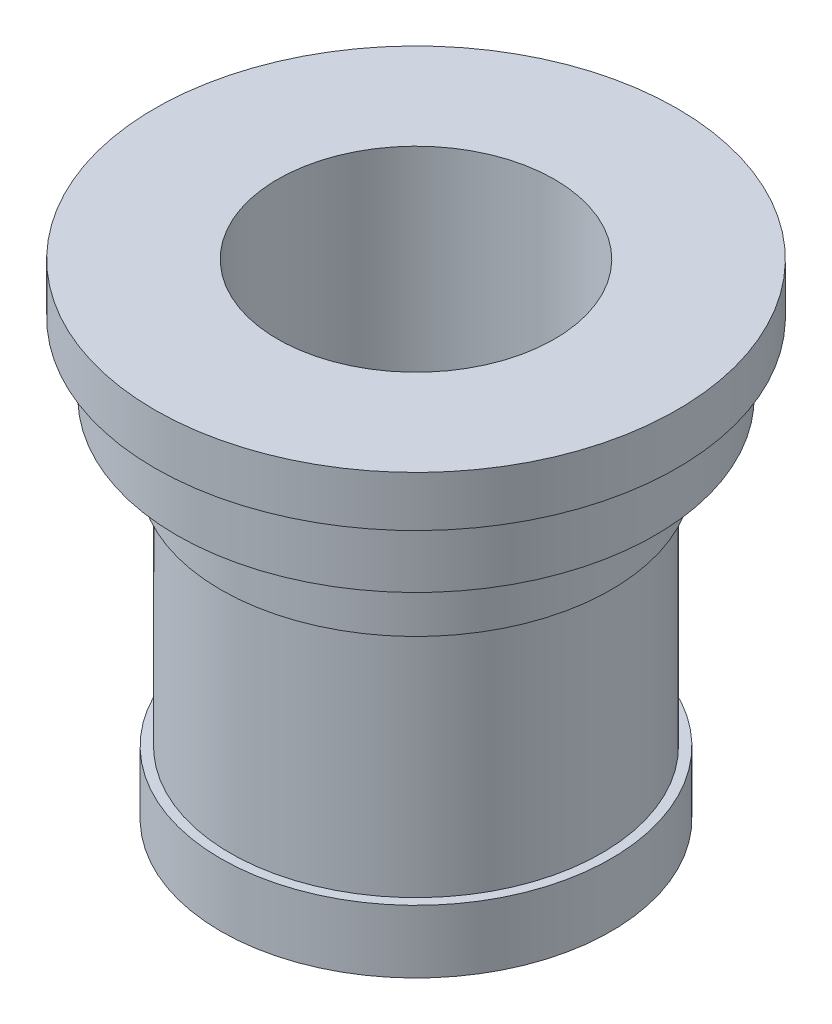
ISO-10303-21;
HEADER;
FILE_DESCRIPTION(('STEP AP214'),'2;1');
FILE_NAME('part.step','',(''),(''),'','','');
FILE_SCHEMA(('AUTOMOTIVE_DESIGN { 1 0 10303 214 1 1 1 1 }'));
ENDSEC;
DATA;
#1=APPLICATION_CONTEXT('core data for automotive mechanical design processes');
#2=APPLICATION_PROTOCOL_DEFINITION('international standard','automotive_design',2000,#1);
#3=PRODUCT_CONTEXT('',#1,'mechanical');
#4=PRODUCT('Part','Part','',(#3));
#5=PRODUCT_RELATED_PRODUCT_CATEGORY('part','',(#4));
#6=PRODUCT_DEFINITION_FORMATION('','',#4);
#7=PRODUCT_DEFINITION_CONTEXT('part definition',#1,'design');
#8=PRODUCT_DEFINITION('design','',#6,#7);
#9=PRODUCT_DEFINITION_SHAPE('','',#8);
#10=(LENGTH_UNIT() NAMED_UNIT(*) SI_UNIT(.MILLI.,.METRE.));
#11=(NAMED_UNIT(*) PLANE_ANGLE_UNIT() SI_UNIT($,.RADIAN.));
#12=(NAMED_UNIT(*) SI_UNIT($,.STERADIAN.) SOLID_ANGLE_UNIT());
#13=UNCERTAINTY_MEASURE_WITH_UNIT(LENGTH_MEASURE(1.E-05),#10,'distance_accuracy_value','');
#14=(GEOMETRIC_REPRESENTATION_CONTEXT(3) GLOBAL_UNCERTAINTY_ASSIGNED_CONTEXT((#13)) GLOBAL_UNIT_ASSIGNED_CONTEXT((#10,
#11,#12)) REPRESENTATION_CONTEXT('',''));
#15=CARTESIAN_POINT('',(0.,0.,0.));
#16=DIRECTION('',(0.,0.,1.));
#17=DIRECTION('',(1.,0.,0.));
#18=AXIS2_PLACEMENT_3D('',#15,#16,#17);
#19=CARTESIAN_POINT('',(41.5,50.2378825634157,0.));
#20=DIRECTION('',(0.,1.,0.));
#21=DIRECTION('',(0.,0.,1.));
#22=AXIS2_PLACEMENT_3D('',#19,#20,#21);
#23=PLANE('',#22);
#24=CARTESIAN_POINT('',(0.,50.2378825634157,0.));
#25=DIRECTION('',(0.,-1.,0.));
#26=DIRECTION('',(0.,0.,-1.));
#27=AXIS2_PLACEMENT_3D('',#24,#25,#26);
#28=CIRCLE('',#27,22.);
#29=CARTESIAN_POINT('',(0.,50.2378825634157,-22.));
#30=VERTEX_POINT('',#29);
#31=EDGE_CURVE('E10',#30,#30,#28,.T.);
#32=ORIENTED_EDGE('',*,*,#31,.T.);
#33=EDGE_LOOP('',(#32));
#34=FACE_BOUND('',#33,.T.);
#35=CARTESIAN_POINT('',(0.,50.2378825634157,0.));
#36=DIRECTION('',(0.,-1.,0.));
#37=DIRECTION('',(0.,0.,-1.));
#38=AXIS2_PLACEMENT_3D('',#35,#36,#37);
#39=CIRCLE('',#38,41.5);
#40=CARTESIAN_POINT('',(0.,50.2378825634157,-41.5));
#41=VERTEX_POINT('',#40);
#42=EDGE_CURVE('E71',#41,#41,#39,.T.);
#43=ORIENTED_EDGE('',*,*,#42,.F.);
#44=EDGE_LOOP('',(#43));
#45=FACE_BOUND('',#44,.T.);
#46=ADVANCED_FACE('F31',(#34,#45),#23,.T.);
#47=CARTESIAN_POINT('',(0.,0.,0.));
#48=DIRECTION('',(0.,-1.,0.));
#49=DIRECTION('',(0.,0.,-1.));
#50=AXIS2_PLACEMENT_3D('',#47,#48,#49);
#51=CYLINDRICAL_SURFACE('',#50,22.);
#52=CARTESIAN_POINT('',(0.,-26.7621174365843,0.));
#53=DIRECTION('',(0.,-1.,0.));
#54=DIRECTION('',(0.,0.,-1.));
#55=AXIS2_PLACEMENT_3D('',#52,#53,#54);
#56=CIRCLE('',#55,22.);
#57=CARTESIAN_POINT('',(0.,-26.7621174365843,-22.));
#58=VERTEX_POINT('',#57);
#59=EDGE_CURVE('E37',#58,#58,#56,.T.);
#60=ORIENTED_EDGE('',*,*,#59,.T.);
#61=EDGE_LOOP('',(#60));
#62=FACE_BOUND('',#61,.T.);
#63=ORIENTED_EDGE('',*,*,#31,.F.);
#64=EDGE_LOOP('',(#63));
#65=FACE_BOUND('',#64,.T.);
#66=ADVANCED_FACE('F79',(#62,#65),#51,.F.);
#67=CARTESIAN_POINT('',(22.,-26.7621174365843,0.));
#68=DIRECTION('',(0.,-1.,0.));
#69=DIRECTION('',(0.,0.,-1.));
#70=AXIS2_PLACEMENT_3D('',#67,#68,#69);
#71=PLANE('',#70);
#72=CARTESIAN_POINT('',(0.,-26.7621174365843,0.));
#73=DIRECTION('',(0.,-1.,0.));
#74=DIRECTION('',(0.,0.,-1.));
#75=AXIS2_PLACEMENT_3D('',#72,#73,#74);
#76=CIRCLE('',#75,31.);
#77=CARTESIAN_POINT('',(0.,-26.7621174365843,-31.));
#78=VERTEX_POINT('',#77);
#79=EDGE_CURVE('E41',#78,#78,#76,.T.);
#80=ORIENTED_EDGE('',*,*,#79,.T.);
#81=EDGE_LOOP('',(#80));
#82=FACE_BOUND('',#81,.T.);
#83=ORIENTED_EDGE('',*,*,#59,.F.);
#84=EDGE_LOOP('',(#83));
#85=FACE_BOUND('',#84,.T.);
#86=ADVANCED_FACE('F83',(#82,#85),#71,.T.);
#87=CARTESIAN_POINT('',(0.,0.,0.));
#88=DIRECTION('',(0.,-1.,0.));
#89=DIRECTION('',(0.,0.,-1.));
#90=AXIS2_PLACEMENT_3D('',#87,#88,#89);
#91=CYLINDRICAL_SURFACE('',#90,31.);
#92=CARTESIAN_POINT('',(0.,-16.7621174365843,0.));
#93=DIRECTION('',(0.,-1.,0.));
#94=DIRECTION('',(0.,0.,-1.));
#95=AXIS2_PLACEMENT_3D('',#92,#93,#94);
#96=CIRCLE('',#95,31.);
#97=CARTESIAN_POINT('',(0.,-16.7621174365843,-31.));
#98=VERTEX_POINT('',#97);
#99=EDGE_CURVE('E45',#98,#98,#96,.T.);
#100=ORIENTED_EDGE('',*,*,#99,.T.);
#101=EDGE_LOOP('',(#100));
#102=FACE_BOUND('',#101,.T.);
#103=ORIENTED_EDGE('',*,*,#79,.F.);
#104=EDGE_LOOP('',(#103));
#105=FACE_BOUND('',#104,.T.);
#106=ADVANCED_FACE('F87',(#102,#105),#91,.T.);
#107=CARTESIAN_POINT('',(31.,-16.7621174365843,0.));
#108=DIRECTION('',(0.,1.,0.));
#109=DIRECTION('',(0.,0.,1.));
#110=AXIS2_PLACEMENT_3D('',#107,#108,#109);
#111=PLANE('',#110);
#112=CARTESIAN_POINT('',(0.,-16.7621174365843,0.));
#113=DIRECTION('',(0.,-1.,0.));
#114=DIRECTION('',(0.,0.,-1.));
#115=AXIS2_PLACEMENT_3D('',#112,#113,#114);
#116=CIRCLE('',#115,29.5);
#117=CARTESIAN_POINT('',(0.,-16.7621174365843,-29.5));
#118=VERTEX_POINT('',#117);
#119=EDGE_CURVE('E50',#118,#118,#116,.T.);
#120=ORIENTED_EDGE('',*,*,#119,.T.);
#121=EDGE_LOOP('',(#120));
#122=FACE_BOUND('',#121,.T.);
#123=ORIENTED_EDGE('',*,*,#99,.F.);
#124=EDGE_LOOP('',(#123));
#125=FACE_BOUND('',#124,.T.);
#126=ADVANCED_FACE('F94',(#122,#125),#111,.T.);
#127=CARTESIAN_POINT('',(0.,0.,0.));
#128=DIRECTION('',(0.,-1.,0.));
#129=DIRECTION('',(0.,0.,-1.));
#130=AXIS2_PLACEMENT_3D('',#127,#128,#129);
#131=CYLINDRICAL_SURFACE('',#130,29.5);
#132=CARTESIAN_POINT('',(0.,20.2378825634157,0.));
#133=DIRECTION('',(0.,-1.,0.));
#134=DIRECTION('',(0.,0.,-1.));
#135=AXIS2_PLACEMENT_3D('',#132,#133,#134);
#136=CIRCLE('',#135,29.5);
#137=CARTESIAN_POINT('',(0.,20.2378825634157,-29.5));
#138=VERTEX_POINT('',#137);
#139=EDGE_CURVE('E53',#138,#138,#136,.T.);
#140=ORIENTED_EDGE('',*,*,#139,.T.);
#141=EDGE_LOOP('',(#140));
#142=FACE_BOUND('',#141,.T.);
#143=ORIENTED_EDGE('',*,*,#119,.F.);
#144=EDGE_LOOP('',(#143));
#145=FACE_BOUND('',#144,.T.);
#146=ADVANCED_FACE('F98',(#142,#145),#131,.T.);
#147=CARTESIAN_POINT('',(29.5,20.2378825634157,0.));
#148=DIRECTION('',(0.,-1.,0.));
#149=DIRECTION('',(0.,0.,-1.));
#150=AXIS2_PLACEMENT_3D('',#147,#148,#149);
#151=PLANE('',#150);
#152=CARTESIAN_POINT('',(0.,20.2378825634157,0.));
#153=DIRECTION('',(0.,-1.,0.));
#154=DIRECTION('',(0.,0.,-1.));
#155=AXIS2_PLACEMENT_3D('',#152,#153,#154);
#156=CIRCLE('',#155,31.);
#157=CARTESIAN_POINT('',(0.,20.2378825634157,-31.));
#158=VERTEX_POINT('',#157);
#159=EDGE_CURVE('E56',#158,#158,#156,.T.);
#160=ORIENTED_EDGE('',*,*,#159,.T.);
#161=EDGE_LOOP('',(#160));
#162=FACE_BOUND('',#161,.T.);
#163=ORIENTED_EDGE('',*,*,#139,.F.);
#164=EDGE_LOOP('',(#163));
#165=FACE_BOUND('',#164,.T.);
#166=ADVANCED_FACE('F102',(#162,#165),#151,.T.);
#167=CARTESIAN_POINT('',(0.,0.,0.));
#168=DIRECTION('',(0.,-1.,0.));
#169=DIRECTION('',(0.,0.,-1.));
#170=AXIS2_PLACEMENT_3D('',#167,#168,#169);
#171=CYLINDRICAL_SURFACE('',#170,31.);
#172=CARTESIAN_POINT('',(0.,31.2378825634157,0.));
#173=DIRECTION('',(0.,-1.,0.));
#174=DIRECTION('',(0.,0.,-1.));
#175=AXIS2_PLACEMENT_3D('',#172,#173,#174);
#176=CIRCLE('',#175,31.);
#177=CARTESIAN_POINT('',(0.,31.2378825634157,-31.));
#178=VERTEX_POINT('',#177);
#179=EDGE_CURVE('E59',#178,#178,#176,.T.);
#180=ORIENTED_EDGE('',*,*,#179,.T.);
#181=EDGE_LOOP('',(#180));
#182=FACE_BOUND('',#181,.T.);
#183=ORIENTED_EDGE('',*,*,#159,.F.);
#184=EDGE_LOOP('',(#183));
#185=FACE_BOUND('',#184,.T.);
#186=ADVANCED_FACE('F106',(#182,#185),#171,.T.);
#187=CARTESIAN_POINT('',(31.,31.2378825634157,0.));
#188=DIRECTION('',(0.,-1.,0.));
#189=DIRECTION('',(0.,0.,-1.));
#190=AXIS2_PLACEMENT_3D('',#187,#188,#189);
#191=PLANE('',#190);
#192=CARTESIAN_POINT('',(0.,31.2378825634157,0.));
#193=DIRECTION('',(0.,-1.,0.));
#194=DIRECTION('',(0.,0.,-1.));
#195=AXIS2_PLACEMENT_3D('',#192,#193,#194);
#196=CIRCLE('',#195,38.);
#197=CARTESIAN_POINT('',(0.,31.2378825634157,-38.));
#198=VERTEX_POINT('',#197);
#199=EDGE_CURVE('E62',#198,#198,#196,.T.);
#200=ORIENTED_EDGE('',*,*,#199,.T.);
#201=EDGE_LOOP('',(#200));
#202=FACE_BOUND('',#201,.T.);
#203=ORIENTED_EDGE('',*,*,#179,.F.);
#204=EDGE_LOOP('',(#203));
#205=FACE_BOUND('',#204,.T.);
#206=ADVANCED_FACE('F110',(#202,#205),#191,.T.);
#207=CARTESIAN_POINT('',(0.,0.,0.));
#208=DIRECTION('',(0.,-1.,0.));
#209=DIRECTION('',(0.,0.,-1.));
#210=AXIS2_PLACEMENT_3D('',#207,#208,#209);
#211=CYLINDRICAL_SURFACE('',#210,38.);
#212=CARTESIAN_POINT('',(0.,42.2378825634157,0.));
#213=DIRECTION('',(0.,-1.,0.));
#214=DIRECTION('',(0.,0.,-1.));
#215=AXIS2_PLACEMENT_3D('',#212,#213,#214);
#216=CIRCLE('',#215,38.);
#217=CARTESIAN_POINT('',(0.,42.2378825634157,-38.));
#218=VERTEX_POINT('',#217);
#219=EDGE_CURVE('E65',#218,#218,#216,.T.);
#220=ORIENTED_EDGE('',*,*,#219,.T.);
#221=EDGE_LOOP('',(#220));
#222=FACE_BOUND('',#221,.T.);
#223=ORIENTED_EDGE('',*,*,#199,.F.);
#224=EDGE_LOOP('',(#223));
#225=FACE_BOUND('',#224,.T.);
#226=ADVANCED_FACE('F114',(#222,#225),#211,.T.);
#227=CARTESIAN_POINT('',(38.,42.2378825634157,0.));
#228=DIRECTION('',(0.,-1.,0.));
#229=DIRECTION('',(0.,0.,-1.));
#230=AXIS2_PLACEMENT_3D('',#227,#228,#229);
#231=PLANE('',#230);
#232=CARTESIAN_POINT('',(0.,42.2378825634157,0.));
#233=DIRECTION('',(0.,-1.,0.));
#234=DIRECTION('',(0.,0.,-1.));
#235=AXIS2_PLACEMENT_3D('',#232,#233,#234);
#236=CIRCLE('',#235,41.5);
#237=CARTESIAN_POINT('',(0.,42.2378825634157,-41.5));
#238=VERTEX_POINT('',#237);
#239=EDGE_CURVE('E68',#238,#238,#236,.T.);
#240=ORIENTED_EDGE('',*,*,#239,.T.);
#241=EDGE_LOOP('',(#240));
#242=FACE_BOUND('',#241,.T.);
#243=ORIENTED_EDGE('',*,*,#219,.F.);
#244=EDGE_LOOP('',(#243));
#245=FACE_BOUND('',#244,.T.);
#246=ADVANCED_FACE('F118',(#242,#245),#231,.T.);
#247=CARTESIAN_POINT('',(0.,0.,0.));
#248=DIRECTION('',(0.,-1.,0.));
#249=DIRECTION('',(0.,0.,-1.));
#250=AXIS2_PLACEMENT_3D('',#247,#248,#249);
#251=CYLINDRICAL_SURFACE('',#250,41.5);
#252=ORIENTED_EDGE('',*,*,#42,.T.);
#253=EDGE_LOOP('',(#252));
#254=FACE_BOUND('',#253,.T.);
#255=ORIENTED_EDGE('',*,*,#239,.F.);
#256=EDGE_LOOP('',(#255));
#257=FACE_BOUND('',#256,.T.);
#258=ADVANCED_FACE('F75',(#254,#257),#251,.T.);
#259=CLOSED_SHELL('',(#46,#66,#86,#106,#126,#146,#166,#186,#206,#226,#246,#258));
#260=MANIFOLD_SOLID_BREP('B2',#259);
#261=ADVANCED_BREP_SHAPE_REPRESENTATION('',(#18,#260),#14);
#262=SHAPE_DEFINITION_REPRESENTATION(#9,#261);
ENDSEC;
END-ISO-10303-21;
